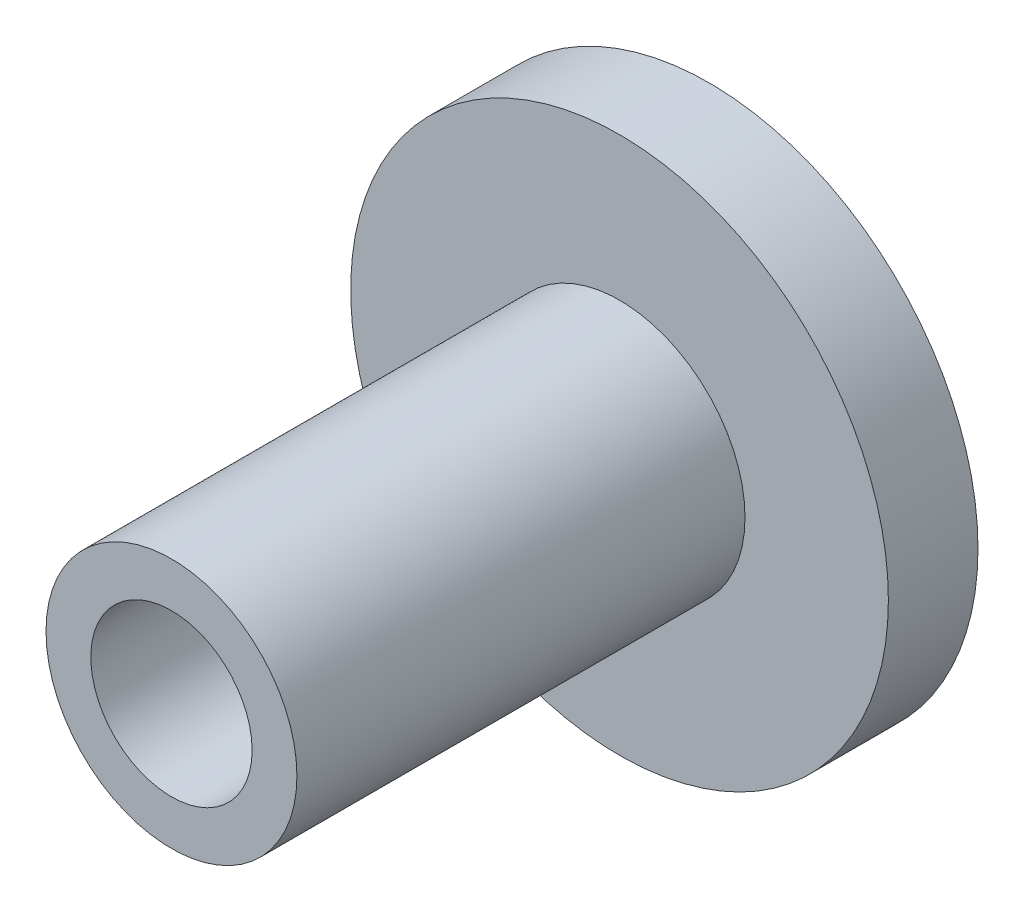
ISO-10303-21;
HEADER;
FILE_DESCRIPTION(('STEP AP214'),'2;1');
FILE_NAME('part.step','',(''),(''),'','','');
FILE_SCHEMA(('AUTOMOTIVE_DESIGN { 1 0 10303 214 1 1 1 1 }'));
ENDSEC;
DATA;
#1=APPLICATION_CONTEXT('core data for automotive mechanical design processes');
#2=APPLICATION_PROTOCOL_DEFINITION('international standard','automotive_design',2000,#1);
#3=PRODUCT_CONTEXT('',#1,'mechanical');
#4=PRODUCT('Part','Part','',(#3));
#5=PRODUCT_RELATED_PRODUCT_CATEGORY('part','',(#4));
#6=PRODUCT_DEFINITION_FORMATION('','',#4);
#7=PRODUCT_DEFINITION_CONTEXT('part definition',#1,'design');
#8=PRODUCT_DEFINITION('design','',#6,#7);
#9=PRODUCT_DEFINITION_SHAPE('','',#8);
#10=(LENGTH_UNIT() NAMED_UNIT(*) SI_UNIT(.MILLI.,.METRE.));
#11=(NAMED_UNIT(*) PLANE_ANGLE_UNIT() SI_UNIT($,.RADIAN.));
#12=(NAMED_UNIT(*) SI_UNIT($,.STERADIAN.) SOLID_ANGLE_UNIT());
#13=UNCERTAINTY_MEASURE_WITH_UNIT(LENGTH_MEASURE(1.E-05),#10,'distance_accuracy_value','');
#14=(GEOMETRIC_REPRESENTATION_CONTEXT(3) GLOBAL_UNCERTAINTY_ASSIGNED_CONTEXT((#13)) GLOBAL_UNIT_ASSIGNED_CONTEXT((#10,
#11,#12)) REPRESENTATION_CONTEXT('',''));
#15=CARTESIAN_POINT('',(0.,0.,0.));
#16=DIRECTION('',(0.,0.,1.));
#17=DIRECTION('',(1.,0.,0.));
#18=AXIS2_PLACEMENT_3D('',#15,#16,#17);
#19=CARTESIAN_POINT('',(0.,0.,5.));
#20=DIRECTION('',(0.,0.,-1.));
#21=DIRECTION('',(-1.,0.,0.));
#22=AXIS2_PLACEMENT_3D('',#19,#20,#21);
#23=CYLINDRICAL_SURFACE('',#22,15.);
#24=CARTESIAN_POINT('',(0.,0.,5.));
#25=DIRECTION('',(0.,0.,1.));
#26=DIRECTION('',(1.,0.,0.));
#27=AXIS2_PLACEMENT_3D('',#24,#25,#26);
#28=CIRCLE('',#27,15.);
#29=CARTESIAN_POINT('',(15.,0.,5.));
#30=VERTEX_POINT('',#29);
#31=EDGE_CURVE('E42',#30,#30,#28,.T.);
#32=ORIENTED_EDGE('',*,*,#31,.F.);
#33=EDGE_LOOP('',(#32));
#34=FACE_BOUND('',#33,.T.);
#35=CARTESIAN_POINT('',(0.,0.,0.));
#36=DIRECTION('',(0.,0.,1.));
#37=DIRECTION('',(1.,0.,0.));
#38=AXIS2_PLACEMENT_3D('',#35,#36,#37);
#39=CIRCLE('',#38,15.);
#40=CARTESIAN_POINT('',(15.,0.,0.));
#41=VERTEX_POINT('',#40);
#42=EDGE_CURVE('E38',#41,#41,#39,.T.);
#43=ORIENTED_EDGE('',*,*,#42,.T.);
#44=EDGE_LOOP('',(#43));
#45=FACE_BOUND('',#44,.T.);
#46=ADVANCED_FACE('F35',(#34,#45),#23,.T.);
#47=CARTESIAN_POINT('',(0.,0.,5.));
#48=DIRECTION('',(0.,0.,1.));
#49=DIRECTION('',(1.,0.,0.));
#50=AXIS2_PLACEMENT_3D('',#47,#48,#49);
#51=PLANE('',#50);
#52=CARTESIAN_POINT('',(0.,0.,5.));
#53=DIRECTION('',(0.,0.,1.));
#54=DIRECTION('',(1.,0.,0.));
#55=AXIS2_PLACEMENT_3D('',#52,#53,#54);
#56=CIRCLE('',#55,7.);
#57=CARTESIAN_POINT('',(7.,0.,5.));
#58=VERTEX_POINT('',#57);
#59=EDGE_CURVE('E10',#58,#58,#56,.T.);
#60=ORIENTED_EDGE('',*,*,#59,.F.);
#61=EDGE_LOOP('',(#60));
#62=FACE_BOUND('',#61,.T.);
#63=ORIENTED_EDGE('',*,*,#31,.T.);
#64=EDGE_LOOP('',(#63));
#65=FACE_BOUND('',#64,.T.);
#66=ADVANCED_FACE('F79',(#62,#65),#51,.T.);
#67=CARTESIAN_POINT('',(0.,0.,0.));
#68=DIRECTION('',(0.,0.,1.));
#69=DIRECTION('',(1.,0.,0.));
#70=AXIS2_PLACEMENT_3D('',#67,#68,#69);
#71=PLANE('',#70);
#72=ORIENTED_EDGE('',*,*,#42,.F.);
#73=EDGE_LOOP('',(#72));
#74=FACE_BOUND('',#73,.T.);
#75=ADVANCED_FACE('F74',(#74),#71,.F.);
#76=CARTESIAN_POINT('',(0.,0.,30.));
#77=DIRECTION('',(0.,0.,-1.));
#78=DIRECTION('',(-1.,0.,0.));
#79=AXIS2_PLACEMENT_3D('',#76,#77,#78);
#80=CYLINDRICAL_SURFACE('',#79,7.);
#81=CARTESIAN_POINT('',(0.,0.,30.));
#82=DIRECTION('',(0.,0.,1.));
#83=DIRECTION('',(1.,0.,0.));
#84=AXIS2_PLACEMENT_3D('',#81,#82,#83);
#85=CIRCLE('',#84,7.);
#86=CARTESIAN_POINT('',(7.,0.,30.));
#87=VERTEX_POINT('',#86);
#88=EDGE_CURVE('E48',#87,#87,#85,.T.);
#89=ORIENTED_EDGE('',*,*,#88,.F.);
#90=EDGE_LOOP('',(#89));
#91=FACE_BOUND('',#90,.T.);
#92=ORIENTED_EDGE('',*,*,#59,.T.);
#93=EDGE_LOOP('',(#92));
#94=FACE_BOUND('',#93,.T.);
#95=ADVANCED_FACE('F69',(#91,#94),#80,.T.);
#96=CARTESIAN_POINT('',(0.,0.,30.));
#97=DIRECTION('',(0.,0.,1.));
#98=DIRECTION('',(1.,0.,0.));
#99=AXIS2_PLACEMENT_3D('',#96,#97,#98);
#100=PLANE('',#99);
#101=CARTESIAN_POINT('',(0.,0.,30.));
#102=DIRECTION('',(0.,0.,1.));
#103=DIRECTION('',(1.,0.,0.));
#104=AXIS2_PLACEMENT_3D('',#101,#102,#103);
#105=CIRCLE('',#104,4.5);
#106=CARTESIAN_POINT('',(4.5,0.,30.));
#107=VERTEX_POINT('',#106);
#108=EDGE_CURVE('E52',#107,#107,#105,.T.);
#109=ORIENTED_EDGE('',*,*,#108,.F.);
#110=EDGE_LOOP('',(#109));
#111=FACE_BOUND('',#110,.T.);
#112=ORIENTED_EDGE('',*,*,#88,.T.);
#113=EDGE_LOOP('',(#112));
#114=FACE_BOUND('',#113,.T.);
#115=ADVANCED_FACE('F63',(#111,#114),#100,.T.);
#116=CARTESIAN_POINT('',(0.,0.,10.));
#117=DIRECTION('',(0.,0.,1.));
#118=DIRECTION('',(1.,0.,0.));
#119=AXIS2_PLACEMENT_3D('',#116,#117,#118);
#120=CYLINDRICAL_SURFACE('',#119,4.5);
#121=CARTESIAN_POINT('',(0.,0.,10.));
#122=DIRECTION('',(0.,0.,1.));
#123=DIRECTION('',(1.,0.,0.));
#124=AXIS2_PLACEMENT_3D('',#121,#122,#123);
#125=CIRCLE('',#124,4.5);
#126=CARTESIAN_POINT('',(4.5,0.,10.));
#127=VERTEX_POINT('',#126);
#128=EDGE_CURVE('E51',#127,#127,#125,.T.);
#129=ORIENTED_EDGE('',*,*,#128,.F.);
#130=EDGE_LOOP('',(#129));
#131=FACE_BOUND('',#130,.T.);
#132=ORIENTED_EDGE('',*,*,#108,.T.);
#133=EDGE_LOOP('',(#132));
#134=FACE_BOUND('',#133,.T.);
#135=ADVANCED_FACE('F60',(#131,#134),#120,.F.);
#136=CARTESIAN_POINT('',(0.,0.,10.));
#137=DIRECTION('',(0.,0.,1.));
#138=DIRECTION('',(1.,0.,0.));
#139=AXIS2_PLACEMENT_3D('',#136,#137,#138);
#140=PLANE('',#139);
#141=ORIENTED_EDGE('',*,*,#128,.T.);
#142=EDGE_LOOP('',(#141));
#143=FACE_BOUND('',#142,.T.);
#144=ADVANCED_FACE('F58',(#143),#140,.T.);
#145=CLOSED_SHELL('',(#46,#66,#75,#95,#115,#135,#144));
#146=MANIFOLD_SOLID_BREP('B2',#145);
#147=ADVANCED_BREP_SHAPE_REPRESENTATION('',(#18,#146),#14);
#148=SHAPE_DEFINITION_REPRESENTATION(#9,#147);
ENDSEC;
END-ISO-10303-21;
